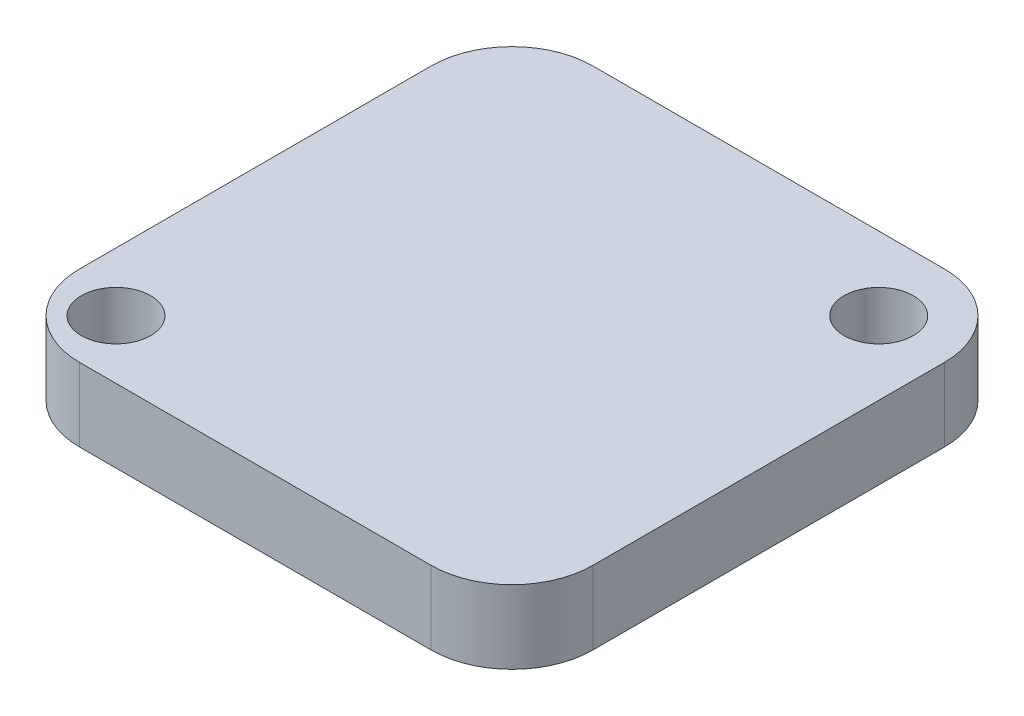
ISO-10303-21;
HEADER;
FILE_DESCRIPTION(('STEP AP214'),'2;1');
FILE_NAME('part.step','',(''),(''),'','','');
FILE_SCHEMA(('AUTOMOTIVE_DESIGN { 1 0 10303 214 1 1 1 1 }'));
ENDSEC;
DATA;
#1=APPLICATION_CONTEXT('core data for automotive mechanical design processes');
#2=APPLICATION_PROTOCOL_DEFINITION('international standard','automotive_design',2000,#1);
#3=PRODUCT_CONTEXT('',#1,'mechanical');
#4=PRODUCT('Part','Part','',(#3));
#5=PRODUCT_RELATED_PRODUCT_CATEGORY('part','',(#4));
#6=PRODUCT_DEFINITION_FORMATION('','',#4);
#7=PRODUCT_DEFINITION_CONTEXT('part definition',#1,'design');
#8=PRODUCT_DEFINITION('design','',#6,#7);
#9=PRODUCT_DEFINITION_SHAPE('','',#8);
#10=(LENGTH_UNIT() NAMED_UNIT(*) SI_UNIT(.MILLI.,.METRE.));
#11=(NAMED_UNIT(*) PLANE_ANGLE_UNIT() SI_UNIT($,.RADIAN.));
#12=(NAMED_UNIT(*) SI_UNIT($,.STERADIAN.) SOLID_ANGLE_UNIT());
#13=UNCERTAINTY_MEASURE_WITH_UNIT(LENGTH_MEASURE(1.E-05),#10,'distance_accuracy_value','');
#14=(GEOMETRIC_REPRESENTATION_CONTEXT(3) GLOBAL_UNCERTAINTY_ASSIGNED_CONTEXT((#13)) GLOBAL_UNIT_ASSIGNED_CONTEXT((#10,
#11,#12)) REPRESENTATION_CONTEXT('',''));
#15=CARTESIAN_POINT('',(0.,0.,0.));
#16=DIRECTION('',(0.,0.,1.));
#17=DIRECTION('',(1.,0.,0.));
#18=AXIS2_PLACEMENT_3D('',#15,#16,#17);
#19=CARTESIAN_POINT('',(-6.0900056,2.54,6.0900056));
#20=DIRECTION('',(0.,1.,0.));
#21=DIRECTION('',(0.,0.,1.));
#22=AXIS2_PLACEMENT_3D('',#19,#20,#21);
#23=PLANE('',#22);
#24=CARTESIAN_POINT('',(6.35,2.54,-6.35));
#25=DIRECTION('',(0.,1.,0.));
#26=DIRECTION('',(0.,0.,1.));
#27=AXIS2_PLACEMENT_3D('',#24,#25,#26);
#28=CIRCLE('',#27,1.2);
#29=CARTESIAN_POINT('',(6.35,2.54,-5.15));
#30=VERTEX_POINT('',#29);
#31=EDGE_CURVE('E139',#30,#30,#28,.T.);
#32=ORIENTED_EDGE('',*,*,#31,.F.);
#33=EDGE_LOOP('',(#32));
#34=FACE_BOUND('',#33,.T.);
#35=CARTESIAN_POINT('',(-6.0900056,2.54,6.0900056));
#36=DIRECTION('',(0.,1.,0.));
#37=DIRECTION('',(0.,0.,1.));
#38=AXIS2_PLACEMENT_3D('',#35,#36,#37);
#39=CIRCLE('',#38,2.7999944);
#40=CARTESIAN_POINT('',(-8.89,2.54,6.0900056));
#41=VERTEX_POINT('',#40);
#42=CARTESIAN_POINT('',(-6.0900056,2.54,8.89));
#43=VERTEX_POINT('',#42);
#44=EDGE_CURVE('E151',#41,#43,#39,.T.);
#45=ORIENTED_EDGE('',*,*,#44,.T.);
#46=DIRECTION('',(1.,0.,0.));
#47=VECTOR('',#46,1.);
#48=CARTESIAN_POINT('',(-6.0900056,2.54,8.89));
#49=LINE('',#48,#47);
#50=CARTESIAN_POINT('',(6.0900056,2.54,8.89));
#51=VERTEX_POINT('',#50);
#52=EDGE_CURVE('E96',#43,#51,#49,.T.);
#53=ORIENTED_EDGE('',*,*,#52,.T.);
#54=CARTESIAN_POINT('',(6.0900056,2.54,6.0900056));
#55=DIRECTION('',(0.,1.,0.));
#56=DIRECTION('',(0.,0.,1.));
#57=AXIS2_PLACEMENT_3D('',#54,#55,#56);
#58=CIRCLE('',#57,2.7999944);
#59=CARTESIAN_POINT('',(8.89,2.54,6.0900056));
#60=VERTEX_POINT('',#59);
#61=EDGE_CURVE('E169',#51,#60,#58,.T.);
#62=ORIENTED_EDGE('',*,*,#61,.T.);
#63=DIRECTION('',(0.,0.,-1.));
#64=VECTOR('',#63,1.);
#65=CARTESIAN_POINT('',(8.89,2.54,-6.0900056));
#66=LINE('',#65,#64);
#67=CARTESIAN_POINT('',(8.89,2.54,-6.0900056));
#68=VERTEX_POINT('',#67);
#69=EDGE_CURVE('E200',#60,#68,#66,.T.);
#70=ORIENTED_EDGE('',*,*,#69,.T.);
#71=CARTESIAN_POINT('',(6.0900056,2.54,-6.0900056));
#72=DIRECTION('',(0.,1.,0.));
#73=DIRECTION('',(0.,0.,-1.));
#74=AXIS2_PLACEMENT_3D('',#71,#72,#73);
#75=CIRCLE('',#74,2.7999944);
#76=CARTESIAN_POINT('',(6.0900056,2.54,-8.89));
#77=VERTEX_POINT('',#76);
#78=EDGE_CURVE('E115',#68,#77,#75,.T.);
#79=ORIENTED_EDGE('',*,*,#78,.T.);
#80=DIRECTION('',(-1.,0.,0.));
#81=VECTOR('',#80,1.);
#82=CARTESIAN_POINT('',(-6.0900056,2.54,-8.89));
#83=LINE('',#82,#81);
#84=CARTESIAN_POINT('',(-6.0900056,2.54,-8.89));
#85=VERTEX_POINT('',#84);
#86=EDGE_CURVE('E109',#77,#85,#83,.T.);
#87=ORIENTED_EDGE('',*,*,#86,.T.);
#88=CARTESIAN_POINT('',(-6.0900056,2.54,-6.0900056));
#89=DIRECTION('',(0.,1.,0.));
#90=DIRECTION('',(0.,0.,1.));
#91=AXIS2_PLACEMENT_3D('',#88,#89,#90);
#92=CIRCLE('',#91,2.7999944);
#93=CARTESIAN_POINT('',(-8.89,2.54,-6.0900056));
#94=VERTEX_POINT('',#93);
#95=EDGE_CURVE('E113',#85,#94,#92,.T.);
#96=ORIENTED_EDGE('',*,*,#95,.T.);
#97=DIRECTION('',(0.,0.,1.));
#98=VECTOR('',#97,1.);
#99=CARTESIAN_POINT('',(-8.89,2.54,-6.0900056));
#100=LINE('',#99,#98);
#101=EDGE_CURVE('E53',#94,#41,#100,.T.);
#102=ORIENTED_EDGE('',*,*,#101,.T.);
#103=EDGE_LOOP('',(#45,#53,#62,#70,#79,#87,#96,#102));
#104=FACE_BOUND('',#103,.T.);
#105=CARTESIAN_POINT('',(-6.858,2.54,6.858));
#106=DIRECTION('',(0.,1.,0.));
#107=DIRECTION('',(0.,0.,1.));
#108=AXIS2_PLACEMENT_3D('',#105,#106,#107);
#109=CIRCLE('',#108,1.2);
#110=CARTESIAN_POINT('',(-6.858,2.54,8.058));
#111=VERTEX_POINT('',#110);
#112=EDGE_CURVE('E196',#111,#111,#109,.T.);
#113=ORIENTED_EDGE('',*,*,#112,.F.);
#114=EDGE_LOOP('',(#113));
#115=FACE_BOUND('',#114,.T.);
#116=ADVANCED_FACE('F36',(#34,#104,#115),#23,.T.);
#117=CARTESIAN_POINT('',(-6.0900056,0.,6.0900056));
#118=DIRECTION('',(0.,1.,0.));
#119=DIRECTION('',(0.,0.,1.));
#120=AXIS2_PLACEMENT_3D('',#117,#118,#119);
#121=PLANE('',#120);
#122=CARTESIAN_POINT('',(-6.0900056,0.,6.0900056));
#123=DIRECTION('',(0.,1.,0.));
#124=DIRECTION('',(0.,0.,1.));
#125=AXIS2_PLACEMENT_3D('',#122,#123,#124);
#126=CIRCLE('',#125,2.7999944);
#127=CARTESIAN_POINT('',(-8.89,0.,6.0900056));
#128=VERTEX_POINT('',#127);
#129=CARTESIAN_POINT('',(-6.0900056,0.,8.89));
#130=VERTEX_POINT('',#129);
#131=EDGE_CURVE('E133',#128,#130,#126,.T.);
#132=ORIENTED_EDGE('',*,*,#131,.F.);
#133=DIRECTION('',(0.,0.,1.));
#134=VECTOR('',#133,1.);
#135=CARTESIAN_POINT('',(-8.89,0.,-6.0900056));
#136=LINE('',#135,#134);
#137=CARTESIAN_POINT('',(-8.89,0.,-6.0900056));
#138=VERTEX_POINT('',#137);
#139=EDGE_CURVE('E88',#138,#128,#136,.T.);
#140=ORIENTED_EDGE('',*,*,#139,.F.);
#141=CARTESIAN_POINT('',(-6.0900056,0.,-6.0900056));
#142=DIRECTION('',(0.,1.,0.));
#143=DIRECTION('',(0.,0.,1.));
#144=AXIS2_PLACEMENT_3D('',#141,#142,#143);
#145=CIRCLE('',#144,2.7999944);
#146=CARTESIAN_POINT('',(-6.0900056,0.,-8.89));
#147=VERTEX_POINT('',#146);
#148=EDGE_CURVE('E82',#147,#138,#145,.T.);
#149=ORIENTED_EDGE('',*,*,#148,.F.);
#150=DIRECTION('',(-1.,0.,0.));
#151=VECTOR('',#150,1.);
#152=CARTESIAN_POINT('',(-6.0900056,0.,-8.89));
#153=LINE('',#152,#151);
#154=CARTESIAN_POINT('',(6.0900056,0.,-8.89));
#155=VERTEX_POINT('',#154);
#156=EDGE_CURVE('E123',#155,#147,#153,.T.);
#157=ORIENTED_EDGE('',*,*,#156,.F.);
#158=CARTESIAN_POINT('',(6.0900056,0.,-6.0900056));
#159=DIRECTION('',(0.,1.,0.));
#160=DIRECTION('',(0.,0.,-1.));
#161=AXIS2_PLACEMENT_3D('',#158,#159,#160);
#162=CIRCLE('',#161,2.7999944);
#163=CARTESIAN_POINT('',(8.89,0.,-6.0900056));
#164=VERTEX_POINT('',#163);
#165=EDGE_CURVE('E180',#164,#155,#162,.T.);
#166=ORIENTED_EDGE('',*,*,#165,.F.);
#167=DIRECTION('',(0.,0.,-1.));
#168=VECTOR('',#167,1.);
#169=CARTESIAN_POINT('',(8.89,0.,-6.0900056));
#170=LINE('',#169,#168);
#171=CARTESIAN_POINT('',(8.89,0.,6.0900056));
#172=VERTEX_POINT('',#171);
#173=EDGE_CURVE('E176',#172,#164,#170,.T.);
#174=ORIENTED_EDGE('',*,*,#173,.F.);
#175=CARTESIAN_POINT('',(6.0900056,0.,6.0900056));
#176=DIRECTION('',(0.,1.,0.));
#177=DIRECTION('',(0.,0.,1.));
#178=AXIS2_PLACEMENT_3D('',#175,#176,#177);
#179=CIRCLE('',#178,2.7999944);
#180=CARTESIAN_POINT('',(6.0900056,0.,8.89));
#181=VERTEX_POINT('',#180);
#182=EDGE_CURVE('E168',#181,#172,#179,.T.);
#183=ORIENTED_EDGE('',*,*,#182,.F.);
#184=DIRECTION('',(1.,0.,0.));
#185=VECTOR('',#184,1.);
#186=CARTESIAN_POINT('',(-6.0900056,0.,8.89));
#187=LINE('',#186,#185);
#188=EDGE_CURVE('E138',#130,#181,#187,.T.);
#189=ORIENTED_EDGE('',*,*,#188,.F.);
#190=EDGE_LOOP('',(#132,#140,#149,#157,#166,#174,#183,#189));
#191=FACE_BOUND('',#190,.T.);
#192=CARTESIAN_POINT('',(6.35,0.,-6.35));
#193=DIRECTION('',(0.,1.,0.));
#194=DIRECTION('',(0.,0.,1.));
#195=AXIS2_PLACEMENT_3D('',#192,#193,#194);
#196=CIRCLE('',#195,1.2);
#197=CARTESIAN_POINT('',(6.35,0.,-5.15));
#198=VERTEX_POINT('',#197);
#199=EDGE_CURVE('E190',#198,#198,#196,.T.);
#200=ORIENTED_EDGE('',*,*,#199,.T.);
#201=EDGE_LOOP('',(#200));
#202=FACE_BOUND('',#201,.T.);
#203=CARTESIAN_POINT('',(-6.858,0.,6.858));
#204=DIRECTION('',(0.,1.,0.));
#205=DIRECTION('',(0.,0.,1.));
#206=AXIS2_PLACEMENT_3D('',#203,#204,#205);
#207=CIRCLE('',#206,1.2);
#208=CARTESIAN_POINT('',(-6.858,0.,8.058));
#209=VERTEX_POINT('',#208);
#210=EDGE_CURVE('E245',#209,#209,#207,.T.);
#211=ORIENTED_EDGE('',*,*,#210,.T.);
#212=EDGE_LOOP('',(#211));
#213=FACE_BOUND('',#212,.T.);
#214=ADVANCED_FACE('F173',(#191,#202,#213),#121,.F.);
#215=CARTESIAN_POINT('',(-6.0900056,2.54,6.0900056));
#216=DIRECTION('',(0.,-1.,0.));
#217=DIRECTION('',(0.,0.,-1.));
#218=AXIS2_PLACEMENT_3D('',#215,#216,#217);
#219=CYLINDRICAL_SURFACE('',#218,2.7999944);
#220=ORIENTED_EDGE('',*,*,#131,.T.);
#221=DIRECTION('',(0.,-1.,0.));
#222=VECTOR('',#221,1.);
#223=CARTESIAN_POINT('',(-6.0900056,2.54,8.89));
#224=LINE('',#223,#222);
#225=EDGE_CURVE('E12',#43,#130,#224,.T.);
#226=ORIENTED_EDGE('',*,*,#225,.F.);
#227=ORIENTED_EDGE('',*,*,#44,.F.);
#228=DIRECTION('',(0.,-1.,0.));
#229=VECTOR('',#228,1.);
#230=CARTESIAN_POINT('',(-8.89,2.54,6.0900056));
#231=LINE('',#230,#229);
#232=EDGE_CURVE('E129',#41,#128,#231,.T.);
#233=ORIENTED_EDGE('',*,*,#232,.T.);
#234=EDGE_LOOP('',(#220,#226,#227,#233));
#235=FACE_BOUND('',#234,.T.);
#236=ADVANCED_FACE('F38',(#235),#219,.T.);
#237=CARTESIAN_POINT('',(-6.0900056,2.54,8.89));
#238=DIRECTION('',(0.,0.,-1.));
#239=DIRECTION('',(-1.,0.,0.));
#240=AXIS2_PLACEMENT_3D('',#237,#238,#239);
#241=PLANE('',#240);
#242=ORIENTED_EDGE('',*,*,#188,.T.);
#243=DIRECTION('',(0.,-1.,0.));
#244=VECTOR('',#243,1.);
#245=CARTESIAN_POINT('',(6.0900056,2.54,8.89));
#246=LINE('',#245,#244);
#247=EDGE_CURVE('E45',#51,#181,#246,.T.);
#248=ORIENTED_EDGE('',*,*,#247,.F.);
#249=ORIENTED_EDGE('',*,*,#52,.F.);
#250=ORIENTED_EDGE('',*,*,#225,.T.);
#251=EDGE_LOOP('',(#242,#248,#249,#250));
#252=FACE_BOUND('',#251,.T.);
#253=ADVANCED_FACE('F297',(#252),#241,.F.);
#254=CARTESIAN_POINT('',(6.0900056,2.54,6.0900056));
#255=DIRECTION('',(0.,-1.,0.));
#256=DIRECTION('',(0.,0.,-1.));
#257=AXIS2_PLACEMENT_3D('',#254,#255,#256);
#258=CYLINDRICAL_SURFACE('',#257,2.7999944);
#259=ORIENTED_EDGE('',*,*,#182,.T.);
#260=DIRECTION('',(0.,-1.,0.));
#261=VECTOR('',#260,1.);
#262=CARTESIAN_POINT('',(8.89,2.54,6.0900056));
#263=LINE('',#262,#261);
#264=EDGE_CURVE('E160',#60,#172,#263,.T.);
#265=ORIENTED_EDGE('',*,*,#264,.F.);
#266=ORIENTED_EDGE('',*,*,#61,.F.);
#267=ORIENTED_EDGE('',*,*,#247,.T.);
#268=EDGE_LOOP('',(#259,#265,#266,#267));
#269=FACE_BOUND('',#268,.T.);
#270=ADVANCED_FACE('F166',(#269),#258,.T.);
#271=CARTESIAN_POINT('',(8.89,2.54,-6.0900056));
#272=DIRECTION('',(-1.,0.,0.));
#273=DIRECTION('',(0.,0.,1.));
#274=AXIS2_PLACEMENT_3D('',#271,#272,#273);
#275=PLANE('',#274);
#276=ORIENTED_EDGE('',*,*,#173,.T.);
#277=DIRECTION('',(0.,-1.,0.));
#278=VECTOR('',#277,1.);
#279=CARTESIAN_POINT('',(8.89,2.54,-6.0900056));
#280=LINE('',#279,#278);
#281=EDGE_CURVE('E157',#68,#164,#280,.T.);
#282=ORIENTED_EDGE('',*,*,#281,.F.);
#283=ORIENTED_EDGE('',*,*,#69,.F.);
#284=ORIENTED_EDGE('',*,*,#264,.T.);
#285=EDGE_LOOP('',(#276,#282,#283,#284));
#286=FACE_BOUND('',#285,.T.);
#287=ADVANCED_FACE('F204',(#286),#275,.F.);
#288=CARTESIAN_POINT('',(6.0900056,2.54,-6.0900056));
#289=DIRECTION('',(0.,-1.,0.));
#290=DIRECTION('',(0.,0.,-1.));
#291=AXIS2_PLACEMENT_3D('',#288,#289,#290);
#292=CYLINDRICAL_SURFACE('',#291,2.7999944);
#293=ORIENTED_EDGE('',*,*,#165,.T.);
#294=DIRECTION('',(0.,-1.,0.));
#295=VECTOR('',#294,1.);
#296=CARTESIAN_POINT('',(6.0900056,2.54,-8.89));
#297=LINE('',#296,#295);
#298=EDGE_CURVE('E124',#77,#155,#297,.T.);
#299=ORIENTED_EDGE('',*,*,#298,.F.);
#300=ORIENTED_EDGE('',*,*,#78,.F.);
#301=ORIENTED_EDGE('',*,*,#281,.T.);
#302=EDGE_LOOP('',(#293,#299,#300,#301));
#303=FACE_BOUND('',#302,.T.);
#304=ADVANCED_FACE('F206',(#303),#292,.T.);
#305=CARTESIAN_POINT('',(-6.0900056,2.54,-8.89));
#306=DIRECTION('',(0.,0.,1.));
#307=DIRECTION('',(1.,0.,0.));
#308=AXIS2_PLACEMENT_3D('',#305,#306,#307);
#309=PLANE('',#308);
#310=ORIENTED_EDGE('',*,*,#156,.T.);
#311=DIRECTION('',(0.,-1.,0.));
#312=VECTOR('',#311,1.);
#313=CARTESIAN_POINT('',(-6.0900056,2.54,-8.89));
#314=LINE('',#313,#312);
#315=EDGE_CURVE('E120',#85,#147,#314,.T.);
#316=ORIENTED_EDGE('',*,*,#315,.F.);
#317=ORIENTED_EDGE('',*,*,#86,.F.);
#318=ORIENTED_EDGE('',*,*,#298,.T.);
#319=EDGE_LOOP('',(#310,#316,#317,#318));
#320=FACE_BOUND('',#319,.T.);
#321=ADVANCED_FACE('F121',(#320),#309,.F.);
#322=CARTESIAN_POINT('',(-6.0900056,2.54,-6.0900056));
#323=DIRECTION('',(0.,-1.,0.));
#324=DIRECTION('',(0.,0.,-1.));
#325=AXIS2_PLACEMENT_3D('',#322,#323,#324);
#326=CYLINDRICAL_SURFACE('',#325,2.7999944);
#327=ORIENTED_EDGE('',*,*,#148,.T.);
#328=DIRECTION('',(0.,-1.,0.));
#329=VECTOR('',#328,1.);
#330=CARTESIAN_POINT('',(-8.89,2.54,-6.0900056));
#331=LINE('',#330,#329);
#332=EDGE_CURVE('E125',#94,#138,#331,.T.);
#333=ORIENTED_EDGE('',*,*,#332,.F.);
#334=ORIENTED_EDGE('',*,*,#95,.F.);
#335=ORIENTED_EDGE('',*,*,#315,.T.);
#336=EDGE_LOOP('',(#327,#333,#334,#335));
#337=FACE_BOUND('',#336,.T.);
#338=ADVANCED_FACE('F127',(#337),#326,.T.);
#339=CARTESIAN_POINT('',(-8.89,2.54,-6.0900056));
#340=DIRECTION('',(1.,0.,0.));
#341=DIRECTION('',(0.,0.,-1.));
#342=AXIS2_PLACEMENT_3D('',#339,#340,#341);
#343=PLANE('',#342);
#344=ORIENTED_EDGE('',*,*,#139,.T.);
#345=ORIENTED_EDGE('',*,*,#232,.F.);
#346=ORIENTED_EDGE('',*,*,#101,.F.);
#347=ORIENTED_EDGE('',*,*,#332,.T.);
#348=EDGE_LOOP('',(#344,#345,#346,#347));
#349=FACE_BOUND('',#348,.T.);
#350=ADVANCED_FACE('F215',(#349),#343,.F.);
#351=CARTESIAN_POINT('',(6.35,2.54,-6.35));
#352=DIRECTION('',(0.,-1.,0.));
#353=DIRECTION('',(0.,0.,-1.));
#354=AXIS2_PLACEMENT_3D('',#351,#352,#353);
#355=CYLINDRICAL_SURFACE('',#354,1.2);
#356=ORIENTED_EDGE('',*,*,#31,.T.);
#357=EDGE_LOOP('',(#356));
#358=FACE_BOUND('',#357,.T.);
#359=ORIENTED_EDGE('',*,*,#199,.F.);
#360=EDGE_LOOP('',(#359));
#361=FACE_BOUND('',#360,.T.);
#362=ADVANCED_FACE('F217',(#358,#361),#355,.F.);
#363=CARTESIAN_POINT('',(-6.858,2.54,6.858));
#364=DIRECTION('',(0.,-1.,0.));
#365=DIRECTION('',(0.,0.,-1.));
#366=AXIS2_PLACEMENT_3D('',#363,#364,#365);
#367=CYLINDRICAL_SURFACE('',#366,1.2);
#368=ORIENTED_EDGE('',*,*,#112,.T.);
#369=EDGE_LOOP('',(#368));
#370=FACE_BOUND('',#369,.T.);
#371=ORIENTED_EDGE('',*,*,#210,.F.);
#372=EDGE_LOOP('',(#371));
#373=FACE_BOUND('',#372,.T.);
#374=ADVANCED_FACE('F223',(#370,#373),#367,.F.);
#375=CLOSED_SHELL('',(#116,#214,#236,#253,#270,#287,#304,#321,#338,#350,#362,#374));
#376=MANIFOLD_SOLID_BREP('B2',#375);
#377=ADVANCED_BREP_SHAPE_REPRESENTATION('',(#18,#376),#14);
#378=SHAPE_DEFINITION_REPRESENTATION(#9,#377);
ENDSEC;
END-ISO-10303-21;
